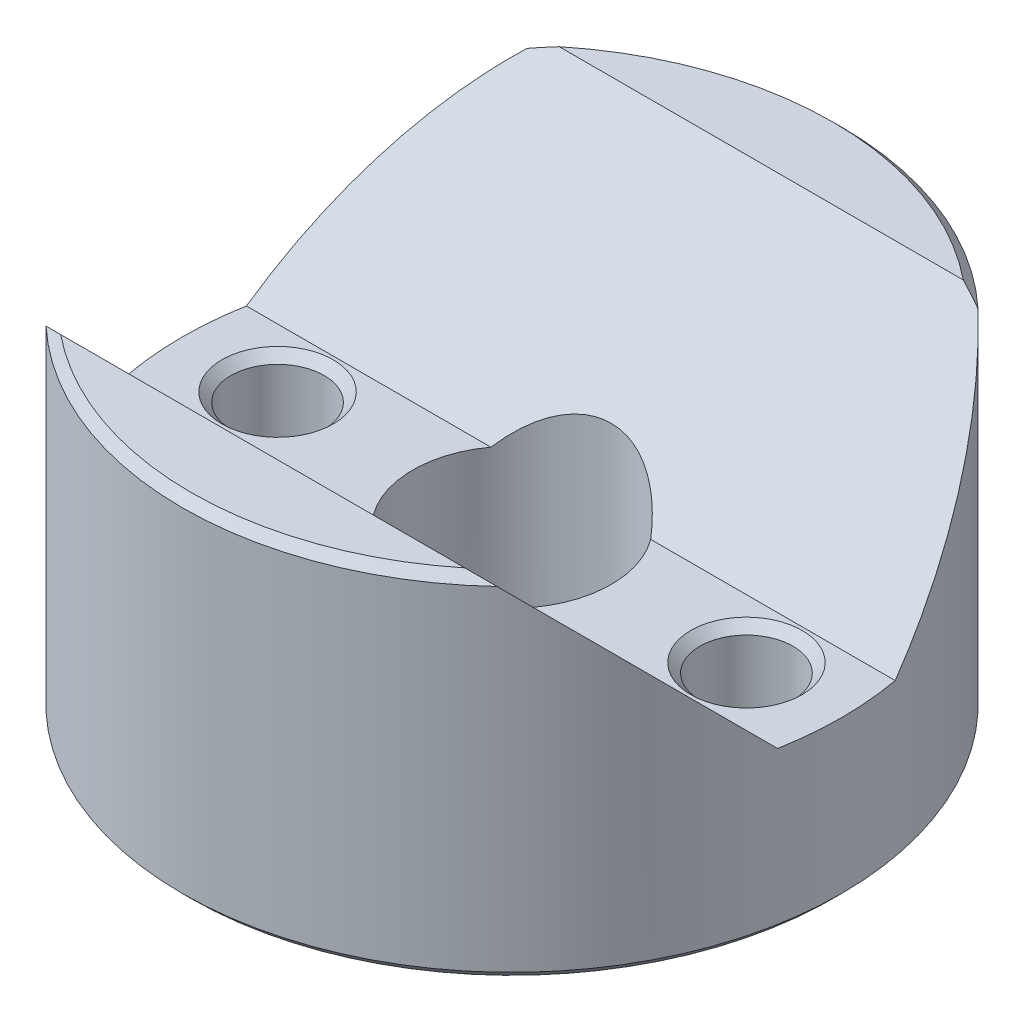
ISO-10303-21;
HEADER;
FILE_DESCRIPTION(('STEP AP214'),'2;1');
FILE_NAME('part.step','',(''),(''),'','','');
FILE_SCHEMA(('AUTOMOTIVE_DESIGN { 1 0 10303 214 1 1 1 1 }'));
ENDSEC;
DATA;
#1=APPLICATION_CONTEXT('core data for automotive mechanical design processes');
#2=APPLICATION_PROTOCOL_DEFINITION('international standard','automotive_design',2000,#1);
#3=PRODUCT_CONTEXT('',#1,'mechanical');
#4=PRODUCT('Part','Part','',(#3));
#5=PRODUCT_RELATED_PRODUCT_CATEGORY('part','',(#4));
#6=PRODUCT_DEFINITION_FORMATION('','',#4);
#7=PRODUCT_DEFINITION_CONTEXT('part definition',#1,'design');
#8=PRODUCT_DEFINITION('design','',#6,#7);
#9=PRODUCT_DEFINITION_SHAPE('','',#8);
#10=(LENGTH_UNIT() NAMED_UNIT(*) SI_UNIT(.MILLI.,.METRE.));
#11=(NAMED_UNIT(*) PLANE_ANGLE_UNIT() SI_UNIT($,.RADIAN.));
#12=(NAMED_UNIT(*) SI_UNIT($,.STERADIAN.) SOLID_ANGLE_UNIT());
#13=UNCERTAINTY_MEASURE_WITH_UNIT(LENGTH_MEASURE(1.E-05),#10,'distance_accuracy_value','');
#14=(GEOMETRIC_REPRESENTATION_CONTEXT(3) GLOBAL_UNCERTAINTY_ASSIGNED_CONTEXT((#13)) GLOBAL_UNIT_ASSIGNED_CONTEXT((#10,
#11,#12)) REPRESENTATION_CONTEXT('',''));
#15=CARTESIAN_POINT('',(0.,0.,0.));
#16=DIRECTION('',(0.,0.,1.));
#17=DIRECTION('',(1.,0.,0.));
#18=AXIS2_PLACEMENT_3D('',#15,#16,#17);
#19=CARTESIAN_POINT('',(-14.2875,6.985,-2.54838418160373));
#20=DIRECTION('',(0.,-1.,0.));
#21=DIRECTION('',(0.,0.,-1.));
#22=AXIS2_PLACEMENT_3D('',#19,#20,#21);
#23=PLANE('',#22);
#24=CARTESIAN_POINT('',(10.16,6.985,0.));
#25=DIRECTION('',(0.,-1.,0.));
#26=DIRECTION('',(0.,0.,-1.));
#27=AXIS2_PLACEMENT_3D('',#24,#25,#26);
#28=CIRCLE('',#27,2.413);
#29=CARTESIAN_POINT('',(10.16,6.985,2.413));
#30=VERTEX_POINT('',#29);
#31=EDGE_CURVE('E146',#30,#30,#28,.T.);
#32=ORIENTED_EDGE('',*,*,#31,.T.);
#33=EDGE_LOOP('',(#32));
#34=FACE_BOUND('',#33,.T.);
#35=DIRECTION('',(1.,0.,0.));
#36=VECTOR('',#35,1.);
#37=CARTESIAN_POINT('',(-14.2875,6.985,-2.54838418160373));
#38=LINE('',#37,#36);
#39=CARTESIAN_POINT('',(3.46348640288248,6.985,-2.54838418160373));
#40=VERTEX_POINT('',#39);
#41=CARTESIAN_POINT('',(14.0583923089716,6.985,-2.54838418160373));
#42=VERTEX_POINT('',#41);
#43=EDGE_CURVE('E120',#40,#42,#38,.T.);
#44=ORIENTED_EDGE('',*,*,#43,.F.);
#45=CARTESIAN_POINT('',(0.,6.985,0.));
#46=DIRECTION('',(0.,-1.,0.));
#47=DIRECTION('',(0.,0.,-1.));
#48=AXIS2_PLACEMENT_3D('',#45,#46,#47);
#49=CIRCLE('',#48,4.3);
#50=CARTESIAN_POINT('',(3.46348640288249,6.985,2.54838418160373));
#51=VERTEX_POINT('',#50);
#52=EDGE_CURVE('E52',#40,#51,#49,.T.);
#53=ORIENTED_EDGE('',*,*,#52,.T.);
#54=DIRECTION('',(1.,0.,0.));
#55=VECTOR('',#54,1.);
#56=CARTESIAN_POINT('',(-14.2875,6.985,2.54838418160373));
#57=LINE('',#56,#55);
#58=CARTESIAN_POINT('',(14.0583923089716,6.985,2.54838418160373));
#59=VERTEX_POINT('',#58);
#60=EDGE_CURVE('E128',#51,#59,#57,.T.);
#61=ORIENTED_EDGE('',*,*,#60,.T.);
#62=CARTESIAN_POINT('',(0.,6.985,0.));
#63=DIRECTION('',(0.,-1.,0.));
#64=DIRECTION('',(0.,0.,-1.));
#65=AXIS2_PLACEMENT_3D('',#62,#63,#64);
#66=CIRCLE('',#65,14.2875);
#67=EDGE_CURVE('E139',#42,#59,#66,.T.);
#68=ORIENTED_EDGE('',*,*,#67,.F.);
#69=EDGE_LOOP('',(#44,#53,#61,#68));
#70=FACE_BOUND('',#69,.T.);
#71=ADVANCED_FACE('F36',(#34,#70),#23,.F.);
#72=CARTESIAN_POINT('',(0.,15.24,0.));
#73=DIRECTION('',(0.,1.,0.));
#74=DIRECTION('',(0.,0.,1.));
#75=AXIS2_PLACEMENT_3D('',#72,#73,#74);
#76=PLANE('',#75);
#77=DIRECTION('',(1.,0.,0.));
#78=VECTOR('',#77,1.);
#79=CARTESIAN_POINT('',(0.,15.24,10.8033841816037));
#80=LINE('',#79,#78);
#81=CARTESIAN_POINT('',(-8.75657652708381,15.24,10.8033841816037));
#82=VERTEX_POINT('',#81);
#83=CARTESIAN_POINT('',(8.75657652708381,15.24,10.8033841816037));
#84=VERTEX_POINT('',#83);
#85=EDGE_CURVE('E136',#82,#84,#80,.T.);
#86=ORIENTED_EDGE('',*,*,#85,.F.);
#87=CARTESIAN_POINT('',(0.,15.24,0.));
#88=DIRECTION('',(0.,1.,0.));
#89=DIRECTION('',(0.,0.,1.));
#90=AXIS2_PLACEMENT_3D('',#87,#88,#89);
#91=CIRCLE('',#90,13.9065);
#92=EDGE_CURVE('E226',#82,#84,#91,.T.);
#93=ORIENTED_EDGE('',*,*,#92,.T.);
#94=EDGE_LOOP('',(#86,#93));
#95=FACE_BOUND('',#94,.T.);
#96=ADVANCED_FACE('F241',(#95),#76,.T.);
#97=CARTESIAN_POINT('',(0.,15.24,0.));
#98=DIRECTION('',(0.,-1.,0.));
#99=DIRECTION('',(0.,0.,-1.));
#100=AXIS2_PLACEMENT_3D('',#97,#98,#99);
#101=CYLINDRICAL_SURFACE('',#100,14.2875);
#102=CARTESIAN_POINT('',(0.,0.381000000000012,0.));
#103=DIRECTION('',(0.,1.,0.));
#104=DIRECTION('',(0.,0.,1.));
#105=AXIS2_PLACEMENT_3D('',#102,#103,#104);
#106=CIRCLE('',#105,14.2875);
#107=CARTESIAN_POINT('',(0.,0.381000000000012,14.2875));
#108=VERTEX_POINT('',#107);
#109=EDGE_CURVE('E174',#108,#108,#106,.T.);
#110=ORIENTED_EDGE('',*,*,#109,.T.);
#111=EDGE_LOOP('',(#110));
#112=FACE_BOUND('',#111,.T.);
#113=CARTESIAN_POINT('',(0.,4.43661581839627,0.));
#114=DIRECTION('',(0.,-0.707106781186548,-0.707106781186547));
#115=DIRECTION('',(0.,-0.707106781186547,0.707106781186548));
#116=AXIS2_PLACEMENT_3D('',#113,#114,#115);
#117=ELLIPSE('',#116,20.2055762724056,14.2875);
#118=CARTESIAN_POINT('',(-14.0583923089716,6.985,-2.54838418160373));
#119=VERTEX_POINT('',#118);
#120=CARTESIAN_POINT('',(-9.77274599184159,14.859,-10.4223841816038));
#121=VERTEX_POINT('',#120);
#122=EDGE_CURVE('E118',#119,#121,#117,.T.);
#123=ORIENTED_EDGE('',*,*,#122,.T.);
#124=CARTESIAN_POINT('',(0.,14.859,0.));
#125=DIRECTION('',(0.,1.,0.));
#126=DIRECTION('',(0.,0.,1.));
#127=AXIS2_PLACEMENT_3D('',#124,#125,#126);
#128=CIRCLE('',#127,14.2875);
#129=CARTESIAN_POINT('',(9.77274599184159,14.859,-10.4223841816038));
#130=VERTEX_POINT('',#129);
#131=EDGE_CURVE('E172',#121,#130,#128,.F.);
#132=ORIENTED_EDGE('',*,*,#131,.T.);
#133=EDGE_CURVE('E119',#130,#42,#117,.T.);
#134=ORIENTED_EDGE('',*,*,#133,.T.);
#135=ORIENTED_EDGE('',*,*,#67,.T.);
#136=CARTESIAN_POINT('',(0.,4.43661581839627,0.));
#137=DIRECTION('',(0.,-0.707106781186548,0.707106781186547));
#138=DIRECTION('',(0.,-0.707106781186547,-0.707106781186548));
#139=AXIS2_PLACEMENT_3D('',#136,#137,#138);
#140=ELLIPSE('',#139,20.2055762724056,14.2875);
#141=CARTESIAN_POINT('',(9.77274599184159,14.859,10.4223841816038));
#142=VERTEX_POINT('',#141);
#143=EDGE_CURVE('E132',#59,#142,#140,.T.);
#144=ORIENTED_EDGE('',*,*,#143,.T.);
#145=CARTESIAN_POINT('',(0.,14.859,0.));
#146=DIRECTION('',(0.,1.,0.));
#147=DIRECTION('',(0.,0.,1.));
#148=AXIS2_PLACEMENT_3D('',#145,#146,#147);
#149=CIRCLE('',#148,14.2875);
#150=CARTESIAN_POINT('',(-9.77274599184159,14.859,10.4223841816038));
#151=VERTEX_POINT('',#150);
#152=EDGE_CURVE('E170',#142,#151,#149,.F.);
#153=ORIENTED_EDGE('',*,*,#152,.T.);
#154=CARTESIAN_POINT('',(-14.0583923089716,6.985,2.54838418160373));
#155=VERTEX_POINT('',#154);
#156=EDGE_CURVE('E130',#151,#155,#140,.T.);
#157=ORIENTED_EDGE('',*,*,#156,.T.);
#158=EDGE_CURVE('E142',#155,#119,#66,.T.);
#159=ORIENTED_EDGE('',*,*,#158,.T.);
#160=EDGE_LOOP('',(#123,#132,#134,#135,#144,#153,#157,#159));
#161=FACE_BOUND('',#160,.T.);
#162=ADVANCED_FACE('F236',(#112,#161),#101,.T.);
#163=DIRECTION('',(-1.,0.,0.));
#164=VECTOR('',#163,1.);
#165=CARTESIAN_POINT('',(0.,15.24,-10.8033841816037));
#166=LINE('',#165,#164);
#167=CARTESIAN_POINT('',(8.75657652708381,15.24,-10.8033841816037));
#168=VERTEX_POINT('',#167);
#169=CARTESIAN_POINT('',(-8.75657652708381,15.24,-10.8033841816037));
#170=VERTEX_POINT('',#169);
#171=EDGE_CURVE('E133',#168,#170,#166,.T.);
#172=ORIENTED_EDGE('',*,*,#171,.F.);
#173=CARTESIAN_POINT('',(0.,15.24,0.));
#174=DIRECTION('',(0.,1.,0.));
#175=DIRECTION('',(0.,0.,1.));
#176=AXIS2_PLACEMENT_3D('',#173,#174,#175);
#177=CIRCLE('',#176,13.9065);
#178=EDGE_CURVE('E180',#168,#170,#177,.T.);
#179=ORIENTED_EDGE('',*,*,#178,.T.);
#180=EDGE_LOOP('',(#172,#179));
#181=FACE_BOUND('',#180,.T.);
#182=ADVANCED_FACE('F213',(#181),#76,.T.);
#183=CARTESIAN_POINT('',(0.,0.,0.));
#184=DIRECTION('',(0.,1.,0.));
#185=DIRECTION('',(0.,0.,1.));
#186=AXIS2_PLACEMENT_3D('',#183,#184,#185);
#187=PLANE('',#186);
#188=CARTESIAN_POINT('',(0.,0.,0.));
#189=DIRECTION('',(0.,1.,0.));
#190=DIRECTION('',(0.,0.,1.));
#191=AXIS2_PLACEMENT_3D('',#188,#189,#190);
#192=CIRCLE('',#191,13.9065);
#193=CARTESIAN_POINT('',(0.,0.,13.9065));
#194=VERTEX_POINT('',#193);
#195=EDGE_CURVE('E177',#194,#194,#192,.F.);
#196=ORIENTED_EDGE('',*,*,#195,.T.);
#197=EDGE_LOOP('',(#196));
#198=FACE_BOUND('',#197,.T.);
#199=CARTESIAN_POINT('',(0.,0.,0.));
#200=DIRECTION('',(0.,-1.,0.));
#201=DIRECTION('',(0.,0.,-1.));
#202=AXIS2_PLACEMENT_3D('',#199,#200,#201);
#203=CIRCLE('',#202,6.35);
#204=CARTESIAN_POINT('',(0.,0.,-6.35));
#205=VERTEX_POINT('',#204);
#206=EDGE_CURVE('E126',#205,#205,#203,.T.);
#207=ORIENTED_EDGE('',*,*,#206,.F.);
#208=EDGE_LOOP('',(#207));
#209=FACE_BOUND('',#208,.T.);
#210=CARTESIAN_POINT('',(10.16,0.,0.));
#211=DIRECTION('',(0.,1.,0.));
#212=DIRECTION('',(0.,0.,1.));
#213=AXIS2_PLACEMENT_3D('',#210,#211,#212);
#214=CIRCLE('',#213,2.41299999999998);
#215=CARTESIAN_POINT('',(10.16,0.,2.41299999999998));
#216=VERTEX_POINT('',#215);
#217=EDGE_CURVE('E158',#216,#216,#214,.T.);
#218=ORIENTED_EDGE('',*,*,#217,.T.);
#219=EDGE_LOOP('',(#218));
#220=FACE_BOUND('',#219,.T.);
#221=CARTESIAN_POINT('',(-10.16,0.,0.));
#222=DIRECTION('',(0.,1.,0.));
#223=DIRECTION('',(0.,0.,1.));
#224=AXIS2_PLACEMENT_3D('',#221,#222,#223);
#225=CIRCLE('',#224,2.41299999999998);
#226=CARTESIAN_POINT('',(-10.16,0.,2.41299999999998));
#227=VERTEX_POINT('',#226);
#228=EDGE_CURVE('E155',#227,#227,#225,.T.);
#229=ORIENTED_EDGE('',*,*,#228,.T.);
#230=EDGE_LOOP('',(#229));
#231=FACE_BOUND('',#230,.T.);
#232=ADVANCED_FACE('F207',(#198,#209,#220,#231),#187,.F.);
#233=CARTESIAN_POINT('',(-10.16,6.985,0.));
#234=DIRECTION('',(0.,-1.,0.));
#235=DIRECTION('',(0.,0.,-1.));
#236=AXIS2_PLACEMENT_3D('',#233,#234,#235);
#237=CIRCLE('',#236,2.413);
#238=CARTESIAN_POINT('',(-10.16,6.985,2.413));
#239=VERTEX_POINT('',#238);
#240=EDGE_CURVE('E143',#239,#239,#237,.T.);
#241=ORIENTED_EDGE('',*,*,#240,.T.);
#242=EDGE_LOOP('',(#241));
#243=FACE_BOUND('',#242,.T.);
#244=CARTESIAN_POINT('',(-3.46348640288249,6.985,2.54838418160373));
#245=VERTEX_POINT('',#244);
#246=EDGE_CURVE('E113',#155,#245,#57,.T.);
#247=ORIENTED_EDGE('',*,*,#246,.T.);
#248=CARTESIAN_POINT('',(-3.46348640288249,6.985,-2.54838418160373));
#249=VERTEX_POINT('',#248);
#250=EDGE_CURVE('E100',#245,#249,#49,.T.);
#251=ORIENTED_EDGE('',*,*,#250,.T.);
#252=EDGE_CURVE('E110',#119,#249,#38,.T.);
#253=ORIENTED_EDGE('',*,*,#252,.F.);
#254=ORIENTED_EDGE('',*,*,#158,.F.);
#255=EDGE_LOOP('',(#247,#251,#253,#254));
#256=FACE_BOUND('',#255,.T.);
#257=ADVANCED_FACE('F108',(#243,#256),#23,.F.);
#258=CARTESIAN_POINT('',(-14.2875,6.985,2.54838418160373));
#259=DIRECTION('',(0.,-0.707106781186548,0.707106781186547));
#260=DIRECTION('',(0.,-0.707106781186547,-0.707106781186548));
#261=AXIS2_PLACEMENT_3D('',#258,#259,#260);
#262=PLANE('',#261);
#263=ORIENTED_EDGE('',*,*,#60,.F.);
#264=CARTESIAN_POINT('',(0.,4.43661581839627,0.));
#265=DIRECTION('',(0.,-0.707106781186548,0.707106781186547));
#266=DIRECTION('',(0.,-0.707106781186547,-0.707106781186548));
#267=AXIS2_PLACEMENT_3D('',#264,#265,#266);
#268=ELLIPSE('',#267,6.0811183182043,4.3);
#269=EDGE_CURVE('E426',#51,#245,#268,.T.);
#270=ORIENTED_EDGE('',*,*,#269,.T.);
#271=ORIENTED_EDGE('',*,*,#246,.F.);
#272=ORIENTED_EDGE('',*,*,#156,.F.);
#273=CARTESIAN_POINT('',(-9.77274599184159,14.859,10.4223841816038));
#274=CARTESIAN_POINT('',(-9.68908101288976,14.8920894462902,10.4554736278939));
#275=CARTESIAN_POINT('',(-9.60515982884211,14.9248553166724,10.4882394982762));
#276=CARTESIAN_POINT('',(-9.43681716577959,14.989719552698,10.5531037343017));
#277=CARTESIAN_POINT('',(-9.3523957525754,15.0218180037477,10.5852021853514));
#278=CARTESIAN_POINT('',(-9.18304280663491,15.0853357253763,10.64871990698));
#279=CARTESIAN_POINT('',(-9.09811127153116,15.1167549928,10.6801391744038));
#280=CARTESIAN_POINT('',(-8.92772964032835,15.1789016635917,10.7422858451955));
#281=CARTESIAN_POINT('',(-8.84227947885759,15.2096289773404,10.7730131589442));
#282=CARTESIAN_POINT('',(-8.75657652708381,15.24,10.8033841816037));
#283=B_SPLINE_CURVE_WITH_KNOTS('',3,(#273,#274,#275,#276,#277,#278,#279,#280,#281,#282),
.UNSPECIFIED.,.F.,.F.,(4,2,2,2,4),(0.,0.287586900668806,0.575136770898512,0.862687976663407,
1.15027621324248),.UNSPECIFIED.);
#284=EDGE_CURVE('E217',#151,#82,#283,.T.);
#285=ORIENTED_EDGE('',*,*,#284,.T.);
#286=ORIENTED_EDGE('',*,*,#85,.T.);
#287=CARTESIAN_POINT('',(8.75657652708381,15.24,10.8033841816037));
#288=CARTESIAN_POINT('',(8.84227947885759,15.2096289773404,10.7730131589442));
#289=CARTESIAN_POINT('',(8.92772964032836,15.1789016635917,10.7422858451955));
#290=CARTESIAN_POINT('',(9.09811127153116,15.1167549928,10.6801391744038));
#291=CARTESIAN_POINT('',(9.18304280663491,15.0853357253763,10.64871990698));
#292=CARTESIAN_POINT('',(9.3523957525754,15.0218180037477,10.5852021853514));
#293=CARTESIAN_POINT('',(9.43681716577959,14.989719552698,10.5531037343017));
#294=CARTESIAN_POINT('',(9.60515982884211,14.9248553166724,10.4882394982762));
#295=CARTESIAN_POINT('',(9.68908101288976,14.8920894462902,10.4554736278939));
#296=CARTESIAN_POINT('',(9.77274599184159,14.859,10.4223841816038));
#297=B_SPLINE_CURVE_WITH_KNOTS('',3,(#287,#288,#289,#290,#291,#292,#293,#294,#295,#296),
.UNSPECIFIED.,.F.,.F.,(4,2,2,2,4),(0.,0.287588236579072,0.575139442343968,0.862689312573668,
1.15027621324248),.UNSPECIFIED.);
#298=EDGE_CURVE('E45',#84,#142,#297,.T.);
#299=ORIENTED_EDGE('',*,*,#298,.T.);
#300=ORIENTED_EDGE('',*,*,#143,.F.);
#301=EDGE_LOOP('',(#263,#270,#271,#272,#285,#286,#299,#300));
#302=FACE_BOUND('',#301,.T.);
#303=ADVANCED_FACE('F202',(#302),#262,.F.);
#304=CARTESIAN_POINT('',(-14.2875,15.24,-10.8033841816037));
#305=DIRECTION('',(0.,-0.707106781186548,-0.707106781186547));
#306=DIRECTION('',(0.,0.707106781186547,-0.707106781186548));
#307=AXIS2_PLACEMENT_3D('',#304,#305,#306);
#308=PLANE('',#307);
#309=ORIENTED_EDGE('',*,*,#252,.T.);
#310=CARTESIAN_POINT('',(0.,4.43661581839627,0.));
#311=DIRECTION('',(0.,-0.707106781186548,-0.707106781186547));
#312=DIRECTION('',(0.,-0.707106781186547,0.707106781186548));
#313=AXIS2_PLACEMENT_3D('',#310,#311,#312);
#314=ELLIPSE('',#313,6.0811183182043,4.3);
#315=EDGE_CURVE('E11',#249,#40,#314,.T.);
#316=ORIENTED_EDGE('',*,*,#315,.T.);
#317=ORIENTED_EDGE('',*,*,#43,.T.);
#318=ORIENTED_EDGE('',*,*,#133,.F.);
#319=CARTESIAN_POINT('',(9.77274599184159,14.859,-10.4223841816038));
#320=CARTESIAN_POINT('',(9.68908101288975,14.8920894462902,-10.4554736278939));
#321=CARTESIAN_POINT('',(9.6051598288421,14.9248553166724,-10.4882394982762));
#322=CARTESIAN_POINT('',(9.43681716577958,14.989719552698,-10.5531037343017));
#323=CARTESIAN_POINT('',(9.3523957525754,15.0218180037477,-10.5852021853514));
#324=CARTESIAN_POINT('',(9.18304280663491,15.0853357253763,-10.64871990698));
#325=CARTESIAN_POINT('',(9.09811127153116,15.1167549928,-10.6801391744038));
#326=CARTESIAN_POINT('',(8.92772964032835,15.1789016635917,-10.7422858451955));
#327=CARTESIAN_POINT('',(8.84227947885759,15.2096289773404,-10.7730131589442));
#328=CARTESIAN_POINT('',(8.75657652708381,15.24,-10.8033841816037));
#329=B_SPLINE_CURVE_WITH_KNOTS('',3,(#319,#320,#321,#322,#323,#324,#325,#326,#327,#328),
.UNSPECIFIED.,.F.,.F.,(4,2,2,2,4),(0.,0.287586900668807,0.575136770898508,0.862687976663403,
1.15027621324247),.UNSPECIFIED.);
#330=EDGE_CURVE('E183',#130,#168,#329,.T.);
#331=ORIENTED_EDGE('',*,*,#330,.T.);
#332=ORIENTED_EDGE('',*,*,#171,.T.);
#333=CARTESIAN_POINT('',(-8.75657652708381,15.24,-10.8033841816037));
#334=CARTESIAN_POINT('',(-8.84227947885759,15.2096289773404,-10.7730131589442));
#335=CARTESIAN_POINT('',(-8.92772964032835,15.1789016635917,-10.7422858451955));
#336=CARTESIAN_POINT('',(-9.09811127153116,15.1167549928,-10.6801391744038));
#337=CARTESIAN_POINT('',(-9.18304280663491,15.0853357253763,-10.64871990698));
#338=CARTESIAN_POINT('',(-9.3523957525754,15.0218180037477,-10.5852021853514));
#339=CARTESIAN_POINT('',(-9.43681716577958,14.989719552698,-10.5531037343017));
#340=CARTESIAN_POINT('',(-9.6051598288421,14.9248553166724,-10.4882394982762));
#341=CARTESIAN_POINT('',(-9.68908101288975,14.8920894462902,-10.4554736278939));
#342=CARTESIAN_POINT('',(-9.77274599184159,14.859,-10.4223841816038));
#343=B_SPLINE_CURVE_WITH_KNOTS('',3,(#333,#334,#335,#336,#337,#338,#339,#340,#341,#342),
.UNSPECIFIED.,.F.,.F.,(4,2,2,2,4),(0.,0.287588236579068,0.575139442343963,0.862689312573664,
1.15027621324247),.UNSPECIFIED.);
#344=EDGE_CURVE('E189',#170,#121,#343,.T.);
#345=ORIENTED_EDGE('',*,*,#344,.T.);
#346=ORIENTED_EDGE('',*,*,#122,.F.);
#347=EDGE_LOOP('',(#309,#316,#317,#318,#331,#332,#345,#346));
#348=FACE_BOUND('',#347,.T.);
#349=ADVANCED_FACE('F116',(#348),#308,.F.);
#350=CARTESIAN_POINT('',(10.16,0.,0.));
#351=DIRECTION('',(0.,-1.,0.));
#352=DIRECTION('',(0.,0.,-1.));
#353=AXIS2_PLACEMENT_3D('',#350,#351,#352);
#354=CYLINDRICAL_SURFACE('',#353,2.01929999999999);
#355=CARTESIAN_POINT('',(10.16,6.59129999999999,0.));
#356=DIRECTION('',(0.,-1.,0.));
#357=DIRECTION('',(0.,0.,-1.));
#358=AXIS2_PLACEMENT_3D('',#355,#356,#357);
#359=CIRCLE('',#358,2.01929999999999);
#360=CARTESIAN_POINT('',(10.16,6.59129999999999,2.01929999999999));
#361=VERTEX_POINT('',#360);
#362=EDGE_CURVE('E152',#361,#361,#359,.F.);
#363=ORIENTED_EDGE('',*,*,#362,.T.);
#364=EDGE_LOOP('',(#363));
#365=FACE_BOUND('',#364,.T.);
#366=CARTESIAN_POINT('',(10.16,0.393699999999993,0.));
#367=DIRECTION('',(0.,1.,0.));
#368=DIRECTION('',(0.,0.,1.));
#369=AXIS2_PLACEMENT_3D('',#366,#367,#368);
#370=CIRCLE('',#369,2.01929999999999);
#371=CARTESIAN_POINT('',(10.16,0.393699999999993,2.01929999999999));
#372=VERTEX_POINT('',#371);
#373=EDGE_CURVE('E149',#372,#372,#370,.F.);
#374=ORIENTED_EDGE('',*,*,#373,.T.);
#375=EDGE_LOOP('',(#374));
#376=FACE_BOUND('',#375,.T.);
#377=ADVANCED_FACE('F201',(#365,#376),#354,.F.);
#378=CARTESIAN_POINT('',(-10.16,0.,0.));
#379=DIRECTION('',(0.,-1.,0.));
#380=DIRECTION('',(0.,0.,-1.));
#381=AXIS2_PLACEMENT_3D('',#378,#379,#380);
#382=CYLINDRICAL_SURFACE('',#381,2.01929999999999);
#383=CARTESIAN_POINT('',(-10.16,6.59129999999999,0.));
#384=DIRECTION('',(0.,-1.,0.));
#385=DIRECTION('',(0.,0.,-1.));
#386=AXIS2_PLACEMENT_3D('',#383,#384,#385);
#387=CIRCLE('',#386,2.01929999999999);
#388=CARTESIAN_POINT('',(-10.16,6.59129999999999,2.01929999999999));
#389=VERTEX_POINT('',#388);
#390=EDGE_CURVE('E164',#389,#389,#387,.F.);
#391=ORIENTED_EDGE('',*,*,#390,.T.);
#392=EDGE_LOOP('',(#391));
#393=FACE_BOUND('',#392,.T.);
#394=CARTESIAN_POINT('',(-10.16,0.393699999999993,0.));
#395=DIRECTION('',(0.,1.,0.));
#396=DIRECTION('',(0.,0.,1.));
#397=AXIS2_PLACEMENT_3D('',#394,#395,#396);
#398=CIRCLE('',#397,2.01929999999999);
#399=CARTESIAN_POINT('',(-10.16,0.393699999999993,2.01929999999999));
#400=VERTEX_POINT('',#399);
#401=EDGE_CURVE('E161',#400,#400,#398,.F.);
#402=ORIENTED_EDGE('',*,*,#401,.T.);
#403=EDGE_LOOP('',(#402));
#404=FACE_BOUND('',#403,.T.);
#405=ADVANCED_FACE('F294',(#393,#404),#382,.F.);
#406=CARTESIAN_POINT('',(10.16,6.985,0.));
#407=DIRECTION('',(0.,1.,0.));
#408=DIRECTION('',(0.,0.,1.));
#409=AXIS2_PLACEMENT_3D('',#406,#407,#408);
#410=CONICAL_SURFACE('',#409,2.413,0.785398163397447);
#411=CARTESIAN_POINT('',(10.16,6.59129999999999,2.01929999999999));
#412=CARTESIAN_POINT('',(10.16,6.59540104166666,2.02340104166666));
#413=CARTESIAN_POINT('',(10.16,6.59950208333332,2.02750208333332));
#414=CARTESIAN_POINT('',(10.16,6.60770416666666,2.03570416666666));
#415=CARTESIAN_POINT('',(10.16,6.61180520833332,2.03980520833332));
#416=CARTESIAN_POINT('',(10.16,6.62000729166666,2.04800729166666));
#417=CARTESIAN_POINT('',(10.16,6.62410833333332,2.05210833333332));
#418=CARTESIAN_POINT('',(10.16,6.63231041666666,2.06031041666666));
#419=CARTESIAN_POINT('',(10.16,6.63641145833332,2.06441145833332));
#420=CARTESIAN_POINT('',(10.16,6.64461354166666,2.07261354166666));
#421=CARTESIAN_POINT('',(10.16,6.64871458333332,2.07671458333333));
#422=CARTESIAN_POINT('',(10.16,6.65691666666666,2.08491666666666));
#423=CARTESIAN_POINT('',(10.16,6.66101770833333,2.08901770833333));
#424=CARTESIAN_POINT('',(10.16,6.66921979166666,2.09721979166666));
#425=CARTESIAN_POINT('',(10.16,6.67332083333333,2.10132083333333));
#426=CARTESIAN_POINT('',(10.16,6.68152291666666,2.10952291666666));
#427=CARTESIAN_POINT('',(10.16,6.68562395833333,2.11362395833333));
#428=CARTESIAN_POINT('',(10.16,6.69382604166666,2.12182604166666));
#429=CARTESIAN_POINT('',(10.16,6.69792708333333,2.12592708333333));
#430=CARTESIAN_POINT('',(10.16,6.70612916666666,2.13412916666666));
#431=CARTESIAN_POINT('',(10.16,6.71023020833333,2.13823020833333));
#432=CARTESIAN_POINT('',(10.16,6.71843229166666,2.14643229166666));
#433=CARTESIAN_POINT('',(10.16,6.72253333333333,2.15053333333333));
#434=CARTESIAN_POINT('',(10.16,6.73073541666666,2.15873541666666));
#435=CARTESIAN_POINT('',(10.16,6.73483645833333,2.16283645833333));
#436=CARTESIAN_POINT('',(10.16,6.74303854166666,2.17103854166666));
#437=CARTESIAN_POINT('',(10.16,6.74713958333333,2.17513958333333));
#438=CARTESIAN_POINT('',(10.16,6.75534166666666,2.18334166666666));
#439=CARTESIAN_POINT('',(10.16,6.75944270833333,2.18744270833333));
#440=CARTESIAN_POINT('',(10.16,6.76764479166666,2.19564479166666));
#441=CARTESIAN_POINT('',(10.16,6.77174583333333,2.19974583333333));
#442=CARTESIAN_POINT('',(10.16,6.77994791666666,2.20794791666666));
#443=CARTESIAN_POINT('',(10.16,6.78404895833333,2.21204895833333));
#444=CARTESIAN_POINT('',(10.16,6.79225104166666,2.22025104166666));
#445=CARTESIAN_POINT('',(10.16,6.79635208333333,2.22435208333333));
#446=CARTESIAN_POINT('',(10.16,6.80455416666666,2.23255416666666));
#447=CARTESIAN_POINT('',(10.16,6.80865520833333,2.23665520833333));
#448=CARTESIAN_POINT('',(10.16,6.81685729166666,2.24485729166666));
#449=CARTESIAN_POINT('',(10.16,6.82095833333333,2.24895833333333));
#450=CARTESIAN_POINT('',(10.16,6.82916041666666,2.25716041666666));
#451=CARTESIAN_POINT('',(10.16,6.83326145833333,2.26126145833333));
#452=CARTESIAN_POINT('',(10.16,6.84146354166666,2.26946354166666));
#453=CARTESIAN_POINT('',(10.16,6.84556458333333,2.27356458333333));
#454=CARTESIAN_POINT('',(10.16,6.85376666666666,2.28176666666666));
#455=CARTESIAN_POINT('',(10.16,6.85786770833333,2.28586770833333));
#456=CARTESIAN_POINT('',(10.16,6.86606979166666,2.29406979166666));
#457=CARTESIAN_POINT('',(10.16,6.87017083333333,2.29817083333333));
#458=CARTESIAN_POINT('',(10.16,6.87837291666666,2.30637291666666));
#459=CARTESIAN_POINT('',(10.16,6.88247395833333,2.31047395833333));
#460=CARTESIAN_POINT('',(10.16,6.89067604166666,2.31867604166666));
#461=CARTESIAN_POINT('',(10.16,6.89477708333333,2.32277708333333));
#462=CARTESIAN_POINT('',(10.16,6.90297916666666,2.33097916666666));
#463=CARTESIAN_POINT('',(10.16,6.90708020833333,2.33508020833333));
#464=CARTESIAN_POINT('',(10.16,6.91528229166667,2.34328229166666));
#465=CARTESIAN_POINT('',(10.16,6.91938333333333,2.34738333333333));
#466=CARTESIAN_POINT('',(10.16,6.92758541666667,2.35558541666667));
#467=CARTESIAN_POINT('',(10.16,6.93168645833333,2.35968645833333));
#468=CARTESIAN_POINT('',(10.16,6.93988854166667,2.36788854166667));
#469=CARTESIAN_POINT('',(10.16,6.94398958333333,2.37198958333333));
#470=CARTESIAN_POINT('',(10.16,6.95219166666667,2.38019166666667));
#471=CARTESIAN_POINT('',(10.16,6.95629270833333,2.38429270833333));
#472=CARTESIAN_POINT('',(10.16,6.96449479166667,2.39249479166667));
#473=CARTESIAN_POINT('',(10.16,6.96859583333333,2.39659583333333));
#474=CARTESIAN_POINT('',(10.16,6.97679791666667,2.40479791666667));
#475=CARTESIAN_POINT('',(10.16,6.98089895833333,2.40889895833333));
#476=CARTESIAN_POINT('',(10.16,6.985,2.413));
#477=B_SPLINE_CURVE_WITH_KNOTS('',3,(#411,#412,#413,#414,#415,#416,#417,#418,#419,#420,#421,
#422,#423,#424,#425,#426,#427,#428,#429,#430,#431,#432,#433,#434,#435,#436,#437,#438,#439,#440,
#441,#442,#443,#444,#445,#446,#447,#448,#449,#450,#451,#452,#453,#454,#455,#456,#457,#458,#459,
#460,#461,#462,#463,#464,#465,#466,#467,#468,#469,#470,#471,#472,#473,#474,#475,#476),
.UNSPECIFIED.,.F.,.F.,(4,2,2,2,2,2,2,2,2,2,2,2,2,2,2,2,2,2,2,2,2,2,2,2,2,2,2,2,2,2,2,2,4),(0.,
0.0173992462345717,0.0347984924691439,0.0521977387037156,0.0695969849382878,0.0869962311728595,
0.104395477407432,0.121794723642003,0.139193969876575,0.156593216111147,0.173992462345719,
0.191391708580291,0.208790954814863,0.226190201049435,0.243589447284007,0.260988693518579,
0.278387939753151,0.295787185987723,0.313186432222295,0.330585678456867,0.347984924691439,
0.36538417092601,0.382783417160583,0.400182663395154,0.417581909629727,0.434981155864298,
0.45238040209887,0.469779648333442,0.487178894568014,0.504578140802586,0.521977387037158,
0.53937663327173,0.556775879506301),.UNSPECIFIED.);
#478=EDGE_CURVE('BSEAM291',#361,#30,#477,.T.);
#479=ORIENTED_EDGE('',*,*,#362,.F.);
#480=ORIENTED_EDGE('',*,*,#31,.F.);
#481=ORIENTED_EDGE('',*,*,#478,.T.);
#482=ORIENTED_EDGE('',*,*,#478,.F.);
#483=EDGE_LOOP('',(#479,#481,#480,#482));
#484=FACE_BOUND('',#483,.T.);
#485=ADVANCED_FACE('F291',(#484),#410,.F.);
#486=CARTESIAN_POINT('',(10.16,0.393699999999993,0.));
#487=DIRECTION('',(0.,-1.,0.));
#488=DIRECTION('',(0.,0.,-1.));
#489=AXIS2_PLACEMENT_3D('',#486,#487,#488);
#490=CONICAL_SURFACE('',#489,2.01929999999999,0.785398163397448);
#491=ORIENTED_EDGE('',*,*,#217,.F.);
#492=EDGE_LOOP('',(#491));
#493=FACE_BOUND('',#492,.T.);
#494=ORIENTED_EDGE('',*,*,#373,.F.);
#495=EDGE_LOOP('',(#494));
#496=FACE_BOUND('',#495,.T.);
#497=ADVANCED_FACE('F287',(#493,#496),#490,.F.);
#498=CARTESIAN_POINT('',(-10.16,6.985,0.));
#499=DIRECTION('',(0.,1.,0.));
#500=DIRECTION('',(0.,0.,1.));
#501=AXIS2_PLACEMENT_3D('',#498,#499,#500);
#502=CONICAL_SURFACE('',#501,2.413,0.785398163397447);
#503=CARTESIAN_POINT('',(-10.16,6.59129999999999,2.01929999999999));
#504=CARTESIAN_POINT('',(-10.16,6.59540104166666,2.02340104166666));
#505=CARTESIAN_POINT('',(-10.16,6.59950208333332,2.02750208333332));
#506=CARTESIAN_POINT('',(-10.16,6.60770416666666,2.03570416666666));
#507=CARTESIAN_POINT('',(-10.16,6.61180520833332,2.03980520833332));
#508=CARTESIAN_POINT('',(-10.16,6.62000729166666,2.04800729166666));
#509=CARTESIAN_POINT('',(-10.16,6.62410833333332,2.05210833333332));
#510=CARTESIAN_POINT('',(-10.16,6.63231041666666,2.06031041666666));
#511=CARTESIAN_POINT('',(-10.16,6.63641145833332,2.06441145833332));
#512=CARTESIAN_POINT('',(-10.16,6.64461354166666,2.07261354166666));
#513=CARTESIAN_POINT('',(-10.16,6.64871458333332,2.07671458333333));
#514=CARTESIAN_POINT('',(-10.16,6.65691666666666,2.08491666666666));
#515=CARTESIAN_POINT('',(-10.16,6.66101770833333,2.08901770833333));
#516=CARTESIAN_POINT('',(-10.16,6.66921979166666,2.09721979166666));
#517=CARTESIAN_POINT('',(-10.16,6.67332083333333,2.10132083333333));
#518=CARTESIAN_POINT('',(-10.16,6.68152291666666,2.10952291666666));
#519=CARTESIAN_POINT('',(-10.16,6.68562395833333,2.11362395833333));
#520=CARTESIAN_POINT('',(-10.16,6.69382604166666,2.12182604166666));
#521=CARTESIAN_POINT('',(-10.16,6.69792708333333,2.12592708333333));
#522=CARTESIAN_POINT('',(-10.16,6.70612916666666,2.13412916666666));
#523=CARTESIAN_POINT('',(-10.16,6.71023020833333,2.13823020833333));
#524=CARTESIAN_POINT('',(-10.16,6.71843229166666,2.14643229166666));
#525=CARTESIAN_POINT('',(-10.16,6.72253333333333,2.15053333333333));
#526=CARTESIAN_POINT('',(-10.16,6.73073541666666,2.15873541666666));
#527=CARTESIAN_POINT('',(-10.16,6.73483645833333,2.16283645833333));
#528=CARTESIAN_POINT('',(-10.16,6.74303854166666,2.17103854166666));
#529=CARTESIAN_POINT('',(-10.16,6.74713958333333,2.17513958333333));
#530=CARTESIAN_POINT('',(-10.16,6.75534166666666,2.18334166666666));
#531=CARTESIAN_POINT('',(-10.16,6.75944270833333,2.18744270833333));
#532=CARTESIAN_POINT('',(-10.16,6.76764479166666,2.19564479166666));
#533=CARTESIAN_POINT('',(-10.16,6.77174583333333,2.19974583333333));
#534=CARTESIAN_POINT('',(-10.16,6.77994791666666,2.20794791666666));
#535=CARTESIAN_POINT('',(-10.16,6.78404895833333,2.21204895833333));
#536=CARTESIAN_POINT('',(-10.16,6.79225104166666,2.22025104166666));
#537=CARTESIAN_POINT('',(-10.16,6.79635208333333,2.22435208333333));
#538=CARTESIAN_POINT('',(-10.16,6.80455416666666,2.23255416666666));
#539=CARTESIAN_POINT('',(-10.16,6.80865520833333,2.23665520833333));
#540=CARTESIAN_POINT('',(-10.16,6.81685729166666,2.24485729166666));
#541=CARTESIAN_POINT('',(-10.16,6.82095833333333,2.24895833333333));
#542=CARTESIAN_POINT('',(-10.16,6.82916041666666,2.25716041666666));
#543=CARTESIAN_POINT('',(-10.16,6.83326145833333,2.26126145833333));
#544=CARTESIAN_POINT('',(-10.16,6.84146354166666,2.26946354166666));
#545=CARTESIAN_POINT('',(-10.16,6.84556458333333,2.27356458333333));
#546=CARTESIAN_POINT('',(-10.16,6.85376666666666,2.28176666666666));
#547=CARTESIAN_POINT('',(-10.16,6.85786770833333,2.28586770833333));
#548=CARTESIAN_POINT('',(-10.16,6.86606979166666,2.29406979166666));
#549=CARTESIAN_POINT('',(-10.16,6.87017083333333,2.29817083333333));
#550=CARTESIAN_POINT('',(-10.16,6.87837291666666,2.30637291666666));
#551=CARTESIAN_POINT('',(-10.16,6.88247395833333,2.31047395833333));
#552=CARTESIAN_POINT('',(-10.16,6.89067604166666,2.31867604166666));
#553=CARTESIAN_POINT('',(-10.16,6.89477708333333,2.32277708333333));
#554=CARTESIAN_POINT('',(-10.16,6.90297916666666,2.33097916666666));
#555=CARTESIAN_POINT('',(-10.16,6.90708020833333,2.33508020833333));
#556=CARTESIAN_POINT('',(-10.16,6.91528229166667,2.34328229166666));
#557=CARTESIAN_POINT('',(-10.16,6.91938333333333,2.34738333333333));
#558=CARTESIAN_POINT('',(-10.16,6.92758541666667,2.35558541666667));
#559=CARTESIAN_POINT('',(-10.16,6.93168645833333,2.35968645833333));
#560=CARTESIAN_POINT('',(-10.16,6.93988854166667,2.36788854166667));
#561=CARTESIAN_POINT('',(-10.16,6.94398958333333,2.37198958333333));
#562=CARTESIAN_POINT('',(-10.16,6.95219166666667,2.38019166666667));
#563=CARTESIAN_POINT('',(-10.16,6.95629270833333,2.38429270833333));
#564=CARTESIAN_POINT('',(-10.16,6.96449479166667,2.39249479166667));
#565=CARTESIAN_POINT('',(-10.16,6.96859583333333,2.39659583333333));
#566=CARTESIAN_POINT('',(-10.16,6.97679791666667,2.40479791666667));
#567=CARTESIAN_POINT('',(-10.16,6.98089895833333,2.40889895833333));
#568=CARTESIAN_POINT('',(-10.16,6.985,2.413));
#569=B_SPLINE_CURVE_WITH_KNOTS('',3,(#503,#504,#505,#506,#507,#508,#509,#510,#511,#512,#513,
#514,#515,#516,#517,#518,#519,#520,#521,#522,#523,#524,#525,#526,#527,#528,#529,#530,#531,#532,
#533,#534,#535,#536,#537,#538,#539,#540,#541,#542,#543,#544,#545,#546,#547,#548,#549,#550,#551,
#552,#553,#554,#555,#556,#557,#558,#559,#560,#561,#562,#563,#564,#565,#566,#567,#568),
.UNSPECIFIED.,.F.,.F.,(4,2,2,2,2,2,2,2,2,2,2,2,2,2,2,2,2,2,2,2,2,2,2,2,2,2,2,2,2,2,2,2,4),(0.,
0.0173992462345717,0.0347984924691439,0.0521977387037156,0.0695969849382878,0.0869962311728595,
0.104395477407432,0.121794723642003,0.139193969876575,0.156593216111147,0.173992462345719,
0.191391708580291,0.208790954814863,0.226190201049435,0.243589447284007,0.260988693518579,
0.278387939753151,0.295787185987723,0.313186432222295,0.330585678456867,0.347984924691439,
0.36538417092601,0.382783417160583,0.400182663395154,0.417581909629727,0.434981155864298,
0.45238040209887,0.469779648333442,0.487178894568014,0.504578140802586,0.521977387037158,
0.53937663327173,0.556775879506301),.UNSPECIFIED.);
#570=EDGE_CURVE('BSEAM283',#389,#239,#569,.T.);
#571=ORIENTED_EDGE('',*,*,#390,.F.);
#572=ORIENTED_EDGE('',*,*,#240,.F.);
#573=ORIENTED_EDGE('',*,*,#570,.T.);
#574=ORIENTED_EDGE('',*,*,#570,.F.);
#575=EDGE_LOOP('',(#571,#573,#572,#574));
#576=FACE_BOUND('',#575,.T.);
#577=ADVANCED_FACE('F283',(#576),#502,.F.);
#578=CARTESIAN_POINT('',(-10.16,0.393699999999993,0.));
#579=DIRECTION('',(0.,-1.,0.));
#580=DIRECTION('',(0.,0.,-1.));
#581=AXIS2_PLACEMENT_3D('',#578,#579,#580);
#582=CONICAL_SURFACE('',#581,2.01929999999999,0.785398163397448);
#583=ORIENTED_EDGE('',*,*,#228,.F.);
#584=EDGE_LOOP('',(#583));
#585=FACE_BOUND('',#584,.T.);
#586=ORIENTED_EDGE('',*,*,#401,.F.);
#587=EDGE_LOOP('',(#586));
#588=FACE_BOUND('',#587,.T.);
#589=ADVANCED_FACE('F280',(#585,#588),#582,.F.);
#590=CARTESIAN_POINT('',(0.,0.635,0.));
#591=DIRECTION('',(0.,-1.,0.));
#592=DIRECTION('',(0.,0.,-1.));
#593=AXIS2_PLACEMENT_3D('',#590,#591,#592);
#594=PLANE('',#593);
#595=CARTESIAN_POINT('',(0.,0.635000000000001,0.));
#596=DIRECTION('',(0.,-1.,0.));
#597=DIRECTION('',(0.,0.,-1.));
#598=AXIS2_PLACEMENT_3D('',#595,#596,#597);
#599=CIRCLE('',#598,4.3);
#600=CARTESIAN_POINT('',(0.,0.635000000000001,-4.3));
#601=VERTEX_POINT('',#600);
#602=EDGE_CURVE('E114',#601,#601,#599,.T.);
#603=ORIENTED_EDGE('',*,*,#602,.F.);
#604=EDGE_LOOP('',(#603));
#605=FACE_BOUND('',#604,.T.);
#606=CARTESIAN_POINT('',(0.,0.635,0.));
#607=DIRECTION('',(0.,-1.,0.));
#608=DIRECTION('',(0.,0.,-1.));
#609=AXIS2_PLACEMENT_3D('',#606,#607,#608);
#610=CIRCLE('',#609,5.71499999999999);
#611=CARTESIAN_POINT('',(0.,0.635,-5.71499999999999));
#612=VERTEX_POINT('',#611);
#613=EDGE_CURVE('E167',#612,#612,#610,.T.);
#614=ORIENTED_EDGE('',*,*,#613,.T.);
#615=EDGE_LOOP('',(#614));
#616=FACE_BOUND('',#615,.T.);
#617=ADVANCED_FACE('F274',(#605,#616),#594,.T.);
#618=CARTESIAN_POINT('',(0.,0.635,0.));
#619=DIRECTION('',(0.,-1.,0.));
#620=DIRECTION('',(0.,0.,-1.));
#621=AXIS2_PLACEMENT_3D('',#618,#619,#620);
#622=CONICAL_SURFACE('',#621,5.71499999999999,0.785398163397454);
#623=ORIENTED_EDGE('',*,*,#206,.T.);
#624=EDGE_LOOP('',(#623));
#625=FACE_BOUND('',#624,.T.);
#626=ORIENTED_EDGE('',*,*,#613,.F.);
#627=EDGE_LOOP('',(#626));
#628=FACE_BOUND('',#627,.T.);
#629=ADVANCED_FACE('F269',(#625,#628),#622,.F.);
#630=CARTESIAN_POINT('',(0.,0.381000000000012,0.));
#631=DIRECTION('',(0.,1.,0.));
#632=DIRECTION('',(0.,0.,1.));
#633=AXIS2_PLACEMENT_3D('',#630,#631,#632);
#634=CONICAL_SURFACE('',#633,14.2875,0.785398163397455);
#635=ORIENTED_EDGE('',*,*,#195,.F.);
#636=EDGE_LOOP('',(#635));
#637=FACE_BOUND('',#636,.T.);
#638=ORIENTED_EDGE('',*,*,#109,.F.);
#639=EDGE_LOOP('',(#638));
#640=FACE_BOUND('',#639,.T.);
#641=ADVANCED_FACE('F265',(#637,#640),#634,.T.);
#642=CARTESIAN_POINT('',(0.,15.24,0.));
#643=DIRECTION('',(0.,-1.,0.));
#644=DIRECTION('',(0.,0.,-1.));
#645=AXIS2_PLACEMENT_3D('',#642,#643,#644);
#646=CONICAL_SURFACE('',#645,13.9065,0.785398163397446);
#647=ORIENTED_EDGE('',*,*,#330,.F.);
#648=ORIENTED_EDGE('',*,*,#131,.F.);
#649=ORIENTED_EDGE('',*,*,#344,.F.);
#650=ORIENTED_EDGE('',*,*,#178,.F.);
#651=EDGE_LOOP('',(#647,#648,#649,#650));
#652=FACE_BOUND('',#651,.T.);
#653=ADVANCED_FACE('F194',(#652),#646,.T.);
#654=CARTESIAN_POINT('',(0.,15.24,0.));
#655=DIRECTION('',(0.,-1.,0.));
#656=DIRECTION('',(0.,0.,-1.));
#657=AXIS2_PLACEMENT_3D('',#654,#655,#656);
#658=CONICAL_SURFACE('',#657,13.9065,0.785398163397446);
#659=ORIENTED_EDGE('',*,*,#284,.F.);
#660=ORIENTED_EDGE('',*,*,#152,.F.);
#661=ORIENTED_EDGE('',*,*,#298,.F.);
#662=ORIENTED_EDGE('',*,*,#92,.F.);
#663=EDGE_LOOP('',(#659,#660,#661,#662));
#664=FACE_BOUND('',#663,.T.);
#665=ADVANCED_FACE('F38',(#664),#658,.T.);
#666=CARTESIAN_POINT('',(0.,0.635,0.));
#667=DIRECTION('',(0.,-1.,0.));
#668=DIRECTION('',(0.,0.,-1.));
#669=AXIS2_PLACEMENT_3D('',#666,#667,#668);
#670=CYLINDRICAL_SURFACE('',#669,4.3);
#671=ORIENTED_EDGE('',*,*,#602,.T.);
#672=EDGE_LOOP('',(#671));
#673=FACE_BOUND('',#672,.T.);
#674=ORIENTED_EDGE('',*,*,#52,.F.);
#675=ORIENTED_EDGE('',*,*,#315,.F.);
#676=ORIENTED_EDGE('',*,*,#250,.F.);
#677=ORIENTED_EDGE('',*,*,#269,.F.);
#678=EDGE_LOOP('',(#674,#675,#676,#677));
#679=FACE_BOUND('',#678,.T.);
#680=ADVANCED_FACE('F99',(#673,#679),#670,.F.);
#681=CLOSED_SHELL('',(#71,#96,#162,#182,#232,#257,#303,#349,#377,#405,#485,#497,#577,#589,#617,
#629,#641,#653,#665,#680));
#682=MANIFOLD_SOLID_BREP('B2',#681);
#683=ADVANCED_BREP_SHAPE_REPRESENTATION('',(#18,#682),#14);
#684=SHAPE_DEFINITION_REPRESENTATION(#9,#683);
ENDSEC;
END-ISO-10303-21;
